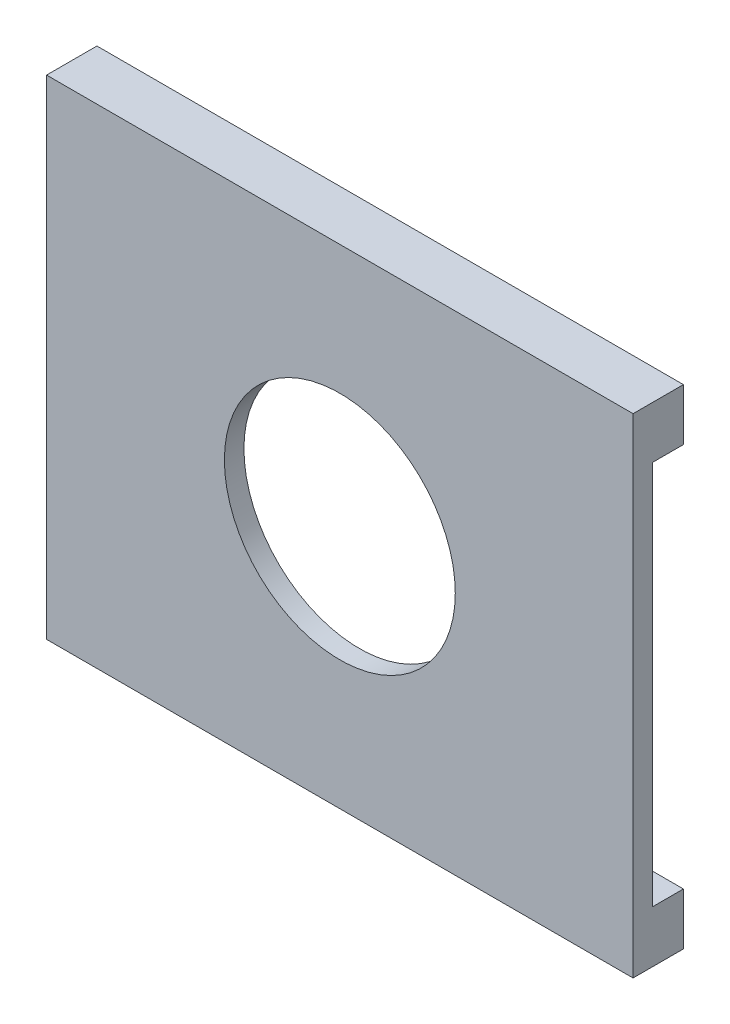
ISO-10303-21;
HEADER;
FILE_DESCRIPTION(('STEP AP214'),'2;1');
FILE_NAME('part.step','',(''),(''),'','','');
FILE_SCHEMA(('AUTOMOTIVE_DESIGN { 1 0 10303 214 1 1 1 1 }'));
ENDSEC;
DATA;
#1=APPLICATION_CONTEXT('core data for automotive mechanical design processes');
#2=APPLICATION_PROTOCOL_DEFINITION('international standard','automotive_design',2000,#1);
#3=PRODUCT_CONTEXT('',#1,'mechanical');
#4=PRODUCT('Part','Part','',(#3));
#5=PRODUCT_RELATED_PRODUCT_CATEGORY('part','',(#4));
#6=PRODUCT_DEFINITION_FORMATION('','',#4);
#7=PRODUCT_DEFINITION_CONTEXT('part definition',#1,'design');
#8=PRODUCT_DEFINITION('design','',#6,#7);
#9=PRODUCT_DEFINITION_SHAPE('','',#8);
#10=(LENGTH_UNIT() NAMED_UNIT(*) SI_UNIT(.MILLI.,.METRE.));
#11=(NAMED_UNIT(*) PLANE_ANGLE_UNIT() SI_UNIT($,.RADIAN.));
#12=(NAMED_UNIT(*) SI_UNIT($,.STERADIAN.) SOLID_ANGLE_UNIT());
#13=UNCERTAINTY_MEASURE_WITH_UNIT(LENGTH_MEASURE(1.E-05),#10,'distance_accuracy_value','');
#14=(GEOMETRIC_REPRESENTATION_CONTEXT(3) GLOBAL_UNCERTAINTY_ASSIGNED_CONTEXT((#13)) GLOBAL_UNIT_ASSIGNED_CONTEXT((#10,
#11,#12)) REPRESENTATION_CONTEXT('',''));
#15=CARTESIAN_POINT('',(0.,0.,0.));
#16=DIRECTION('',(0.,0.,1.));
#17=DIRECTION('',(1.,0.,0.));
#18=AXIS2_PLACEMENT_3D('',#15,#16,#17);
#19=CARTESIAN_POINT('',(0.,0.,0.));
#20=DIRECTION('',(0.,0.,-1.));
#21=DIRECTION('',(-1.,0.,0.));
#22=AXIS2_PLACEMENT_3D('',#19,#20,#21);
#23=PLANE('',#22);
#24=CARTESIAN_POINT('',(38.1,31.75,0.));
#25=DIRECTION('',(0.,0.,-1.));
#26=DIRECTION('',(-1.,0.,0.));
#27=AXIS2_PLACEMENT_3D('',#24,#25,#26);
#28=CIRCLE('',#27,15.);
#29=CARTESIAN_POINT('',(23.1,31.75,0.));
#30=VERTEX_POINT('',#29);
#31=EDGE_CURVE('E221',#30,#30,#28,.T.);
#32=ORIENTED_EDGE('',*,*,#31,.F.);
#33=EDGE_LOOP('',(#32));
#34=FACE_BOUND('',#33,.T.);
#35=DIRECTION('',(-1.,0.,0.));
#36=VECTOR('',#35,1.);
#37=CARTESIAN_POINT('',(0.,56.75,0.));
#38=LINE('',#37,#36);
#39=CARTESIAN_POINT('',(24.13,56.75,0.));
#40=VERTEX_POINT('',#39);
#41=CARTESIAN_POINT('',(0.,56.75,0.));
#42=VERTEX_POINT('',#41);
#43=EDGE_CURVE('E51',#40,#42,#38,.T.);
#44=ORIENTED_EDGE('',*,*,#43,.F.);
#45=DIRECTION('',(0.,1.,0.));
#46=VECTOR('',#45,1.);
#47=CARTESIAN_POINT('',(24.13,46.59,0.));
#48=LINE('',#47,#46);
#49=CARTESIAN_POINT('',(24.13,46.59,0.));
#50=VERTEX_POINT('',#49);
#51=EDGE_CURVE('E164',#50,#40,#48,.T.);
#52=ORIENTED_EDGE('',*,*,#51,.F.);
#53=DIRECTION('',(1.,0.,0.));
#54=VECTOR('',#53,1.);
#55=CARTESIAN_POINT('',(24.13,46.59,0.));
#56=LINE('',#55,#54);
#57=CARTESIAN_POINT('',(27.94,46.59,0.));
#58=VERTEX_POINT('',#57);
#59=EDGE_CURVE('E173',#50,#58,#56,.T.);
#60=ORIENTED_EDGE('',*,*,#59,.T.);
#61=DIRECTION('',(0.,1.,0.));
#62=VECTOR('',#61,1.);
#63=CARTESIAN_POINT('',(27.94,46.59,0.));
#64=LINE('',#63,#62);
#65=CARTESIAN_POINT('',(27.94,56.75,0.));
#66=VERTEX_POINT('',#65);
#67=EDGE_CURVE('E178',#58,#66,#64,.T.);
#68=ORIENTED_EDGE('',*,*,#67,.T.);
#69=CARTESIAN_POINT('',(76.2,56.75,0.));
#70=VERTEX_POINT('',#69);
#71=EDGE_CURVE('E271',#70,#66,#38,.T.);
#72=ORIENTED_EDGE('',*,*,#71,.F.);
#73=DIRECTION('',(0.,1.,0.));
#74=VECTOR('',#73,1.);
#75=CARTESIAN_POINT('',(76.2,0.,0.));
#76=LINE('',#75,#74);
#77=CARTESIAN_POINT('',(76.2,6.75,0.));
#78=VERTEX_POINT('',#77);
#79=EDGE_CURVE('E297',#78,#70,#76,.T.);
#80=ORIENTED_EDGE('',*,*,#79,.F.);
#81=DIRECTION('',(1.,0.,0.));
#82=VECTOR('',#81,1.);
#83=CARTESIAN_POINT('',(0.,6.75,0.));
#84=LINE('',#83,#82);
#85=CARTESIAN_POINT('',(27.94,6.75,0.));
#86=VERTEX_POINT('',#85);
#87=EDGE_CURVE('E246',#86,#78,#84,.T.);
#88=ORIENTED_EDGE('',*,*,#87,.F.);
#89=DIRECTION('',(0.,-1.,0.));
#90=VECTOR('',#89,1.);
#91=CARTESIAN_POINT('',(27.94,16.91,0.));
#92=LINE('',#91,#90);
#93=CARTESIAN_POINT('',(27.94,16.91,0.));
#94=VERTEX_POINT('',#93);
#95=EDGE_CURVE('E185',#94,#86,#92,.T.);
#96=ORIENTED_EDGE('',*,*,#95,.F.);
#97=DIRECTION('',(1.,0.,0.));
#98=VECTOR('',#97,1.);
#99=CARTESIAN_POINT('',(24.13,16.91,0.));
#100=LINE('',#99,#98);
#101=CARTESIAN_POINT('',(24.13,16.91,0.));
#102=VERTEX_POINT('',#101);
#103=EDGE_CURVE('E182',#102,#94,#100,.T.);
#104=ORIENTED_EDGE('',*,*,#103,.F.);
#105=DIRECTION('',(0.,-1.,0.));
#106=VECTOR('',#105,1.);
#107=CARTESIAN_POINT('',(24.13,16.91,0.));
#108=LINE('',#107,#106);
#109=CARTESIAN_POINT('',(24.13,6.75,0.));
#110=VERTEX_POINT('',#109);
#111=EDGE_CURVE('E200',#102,#110,#108,.T.);
#112=ORIENTED_EDGE('',*,*,#111,.T.);
#113=CARTESIAN_POINT('',(0.,6.75,0.));
#114=VERTEX_POINT('',#113);
#115=EDGE_CURVE('E253',#114,#110,#84,.T.);
#116=ORIENTED_EDGE('',*,*,#115,.F.);
#117=DIRECTION('',(0.,-1.,0.));
#118=VECTOR('',#117,1.);
#119=CARTESIAN_POINT('',(0.,0.,0.));
#120=LINE('',#119,#118);
#121=EDGE_CURVE('E287',#42,#114,#120,.T.);
#122=ORIENTED_EDGE('',*,*,#121,.F.);
#123=EDGE_LOOP('',(#44,#52,#60,#68,#72,#80,#88,#96,#104,#112,#116,#122));
#124=FACE_BOUND('',#123,.T.);
#125=ADVANCED_FACE('F47',(#34,#124),#23,.T.);
#126=CARTESIAN_POINT('',(0.,56.75,-4.));
#127=DIRECTION('',(0.,1.,0.));
#128=DIRECTION('',(0.,0.,1.));
#129=AXIS2_PLACEMENT_3D('',#126,#127,#128);
#130=PLANE('',#129);
#131=DIRECTION('',(0.,0.,1.));
#132=VECTOR('',#131,1.);
#133=CARTESIAN_POINT('',(24.13,56.75,-1.27));
#134=LINE('',#133,#132);
#135=CARTESIAN_POINT('',(24.13,56.75,-1.27));
#136=VERTEX_POINT('',#135);
#137=EDGE_CURVE('E65',#136,#40,#134,.T.);
#138=ORIENTED_EDGE('',*,*,#137,.T.);
#139=ORIENTED_EDGE('',*,*,#43,.T.);
#140=DIRECTION('',(0.,0.,1.));
#141=VECTOR('',#140,1.);
#142=CARTESIAN_POINT('',(0.,56.75,-4.));
#143=LINE('',#142,#141);
#144=CARTESIAN_POINT('',(0.,56.75,-4.));
#145=VERTEX_POINT('',#144);
#146=EDGE_CURVE('E277',#145,#42,#143,.T.);
#147=ORIENTED_EDGE('',*,*,#146,.F.);
#148=DIRECTION('',(-1.,0.,0.));
#149=VECTOR('',#148,1.);
#150=CARTESIAN_POINT('',(0.,56.75,-4.));
#151=LINE('',#150,#149);
#152=CARTESIAN_POINT('',(76.2,56.75,-4.));
#153=VERTEX_POINT('',#152);
#154=EDGE_CURVE('E273',#153,#145,#151,.T.);
#155=ORIENTED_EDGE('',*,*,#154,.F.);
#156=DIRECTION('',(0.,0.,1.));
#157=VECTOR('',#156,1.);
#158=CARTESIAN_POINT('',(76.2,56.75,-4.));
#159=LINE('',#158,#157);
#160=EDGE_CURVE('E291',#153,#70,#159,.T.);
#161=ORIENTED_EDGE('',*,*,#160,.T.);
#162=ORIENTED_EDGE('',*,*,#71,.T.);
#163=DIRECTION('',(0.,0.,1.));
#164=VECTOR('',#163,1.);
#165=CARTESIAN_POINT('',(27.94,56.75,-1.27));
#166=LINE('',#165,#164);
#167=CARTESIAN_POINT('',(27.94,56.75,-1.27));
#168=VERTEX_POINT('',#167);
#169=EDGE_CURVE('E540',#168,#66,#166,.T.);
#170=ORIENTED_EDGE('',*,*,#169,.F.);
#171=DIRECTION('',(1.,0.,0.));
#172=VECTOR('',#171,1.);
#173=CARTESIAN_POINT('',(24.13,56.75,-1.27));
#174=LINE('',#173,#172);
#175=EDGE_CURVE('E193',#136,#168,#174,.T.);
#176=ORIENTED_EDGE('',*,*,#175,.F.);
#177=EDGE_LOOP('',(#138,#139,#147,#155,#161,#162,#170,#176));
#178=FACE_BOUND('',#177,.T.);
#179=ADVANCED_FACE('F335',(#178),#130,.F.);
#180=CARTESIAN_POINT('',(0.,6.75,-4.));
#181=DIRECTION('',(0.,-1.,0.));
#182=DIRECTION('',(0.,0.,-1.));
#183=AXIS2_PLACEMENT_3D('',#180,#181,#182);
#184=PLANE('',#183);
#185=DIRECTION('',(0.,0.,1.));
#186=VECTOR('',#185,1.);
#187=CARTESIAN_POINT('',(27.94,6.75,-1.27));
#188=LINE('',#187,#186);
#189=CARTESIAN_POINT('',(27.94,6.75,-1.27));
#190=VERTEX_POINT('',#189);
#191=EDGE_CURVE('E73',#190,#86,#188,.T.);
#192=ORIENTED_EDGE('',*,*,#191,.T.);
#193=ORIENTED_EDGE('',*,*,#87,.T.);
#194=DIRECTION('',(0.,0.,1.));
#195=VECTOR('',#194,1.);
#196=CARTESIAN_POINT('',(76.2,6.75,-4.));
#197=LINE('',#196,#195);
#198=CARTESIAN_POINT('',(76.2,6.75,-4.));
#199=VERTEX_POINT('',#198);
#200=EDGE_CURVE('E260',#199,#78,#197,.T.);
#201=ORIENTED_EDGE('',*,*,#200,.F.);
#202=DIRECTION('',(1.,0.,0.));
#203=VECTOR('',#202,1.);
#204=CARTESIAN_POINT('',(0.,6.75,-4.));
#205=LINE('',#204,#203);
#206=CARTESIAN_POINT('',(0.,6.75,-4.));
#207=VERTEX_POINT('',#206);
#208=EDGE_CURVE('E258',#207,#199,#205,.T.);
#209=ORIENTED_EDGE('',*,*,#208,.F.);
#210=DIRECTION('',(0.,0.,1.));
#211=VECTOR('',#210,1.);
#212=CARTESIAN_POINT('',(0.,6.75,-4.));
#213=LINE('',#212,#211);
#214=EDGE_CURVE('E265',#207,#114,#213,.T.);
#215=ORIENTED_EDGE('',*,*,#214,.T.);
#216=ORIENTED_EDGE('',*,*,#115,.T.);
#217=DIRECTION('',(0.,0.,1.));
#218=VECTOR('',#217,1.);
#219=CARTESIAN_POINT('',(24.13,6.75,-1.27));
#220=LINE('',#219,#218);
#221=CARTESIAN_POINT('',(24.13,6.75,-1.27));
#222=VERTEX_POINT('',#221);
#223=EDGE_CURVE('E213',#222,#110,#220,.T.);
#224=ORIENTED_EDGE('',*,*,#223,.F.);
#225=DIRECTION('',(1.,0.,0.));
#226=VECTOR('',#225,1.);
#227=CARTESIAN_POINT('',(24.13,6.75,-1.27));
#228=LINE('',#227,#226);
#229=EDGE_CURVE('E202',#222,#190,#228,.T.);
#230=ORIENTED_EDGE('',*,*,#229,.T.);
#231=EDGE_LOOP('',(#192,#193,#201,#209,#215,#216,#224,#230));
#232=FACE_BOUND('',#231,.T.);
#233=ADVANCED_FACE('F326',(#232),#184,.F.);
#234=CARTESIAN_POINT('',(0.,0.,2.54));
#235=DIRECTION('',(1.,0.,0.));
#236=DIRECTION('',(0.,0.,-1.));
#237=AXIS2_PLACEMENT_3D('',#234,#235,#236);
#238=PLANE('',#237);
#239=DIRECTION('',(0.,0.,-1.));
#240=VECTOR('',#239,1.);
#241=CARTESIAN_POINT('',(0.,63.5,2.54));
#242=LINE('',#241,#240);
#243=CARTESIAN_POINT('',(0.,63.5,2.54));
#244=VERTEX_POINT('',#243);
#245=CARTESIAN_POINT('',(0.,63.5,-4.));
#246=VERTEX_POINT('',#245);
#247=EDGE_CURVE('E303',#244,#246,#242,.T.);
#248=ORIENTED_EDGE('',*,*,#247,.T.);
#249=DIRECTION('',(0.,1.,0.));
#250=VECTOR('',#249,1.);
#251=CARTESIAN_POINT('',(0.,63.5,-4.));
#252=LINE('',#251,#250);
#253=EDGE_CURVE('E275',#145,#246,#252,.T.);
#254=ORIENTED_EDGE('',*,*,#253,.F.);
#255=ORIENTED_EDGE('',*,*,#146,.T.);
#256=ORIENTED_EDGE('',*,*,#121,.T.);
#257=ORIENTED_EDGE('',*,*,#214,.F.);
#258=DIRECTION('',(0.,1.,0.));
#259=VECTOR('',#258,1.);
#260=CARTESIAN_POINT('',(0.,0.,-4.));
#261=LINE('',#260,#259);
#262=CARTESIAN_POINT('',(0.,0.,-4.));
#263=VERTEX_POINT('',#262);
#264=EDGE_CURVE('E256',#263,#207,#261,.T.);
#265=ORIENTED_EDGE('',*,*,#264,.F.);
#266=DIRECTION('',(0.,0.,-1.));
#267=VECTOR('',#266,1.);
#268=CARTESIAN_POINT('',(0.,0.,2.54));
#269=LINE('',#268,#267);
#270=CARTESIAN_POINT('',(0.,0.,2.54));
#271=VERTEX_POINT('',#270);
#272=EDGE_CURVE('E13',#271,#263,#269,.T.);
#273=ORIENTED_EDGE('',*,*,#272,.F.);
#274=DIRECTION('',(0.,-1.,0.));
#275=VECTOR('',#274,1.);
#276=CARTESIAN_POINT('',(0.,0.,2.54));
#277=LINE('',#276,#275);
#278=EDGE_CURVE('E280',#244,#271,#277,.T.);
#279=ORIENTED_EDGE('',*,*,#278,.F.);
#280=EDGE_LOOP('',(#248,#254,#255,#256,#257,#265,#273,#279));
#281=FACE_BOUND('',#280,.T.);
#282=ADVANCED_FACE('F49',(#281),#238,.F.);
#283=CARTESIAN_POINT('',(0.,0.,2.54));
#284=DIRECTION('',(0.,1.,0.));
#285=DIRECTION('',(0.,0.,1.));
#286=AXIS2_PLACEMENT_3D('',#283,#284,#285);
#287=PLANE('',#286);
#288=ORIENTED_EDGE('',*,*,#272,.T.);
#289=DIRECTION('',(-1.,0.,0.));
#290=VECTOR('',#289,1.);
#291=CARTESIAN_POINT('',(76.2,0.,-4.));
#292=LINE('',#291,#290);
#293=CARTESIAN_POINT('',(76.2,0.,-4.));
#294=VERTEX_POINT('',#293);
#295=EDGE_CURVE('E252',#294,#263,#292,.T.);
#296=ORIENTED_EDGE('',*,*,#295,.F.);
#297=DIRECTION('',(0.,0.,-1.));
#298=VECTOR('',#297,1.);
#299=CARTESIAN_POINT('',(76.2,0.,2.54));
#300=LINE('',#299,#298);
#301=CARTESIAN_POINT('',(76.2,0.,2.54));
#302=VERTEX_POINT('',#301);
#303=EDGE_CURVE('E57',#302,#294,#300,.T.);
#304=ORIENTED_EDGE('',*,*,#303,.F.);
#305=DIRECTION('',(1.,0.,0.));
#306=VECTOR('',#305,1.);
#307=CARTESIAN_POINT('',(0.,0.,2.54));
#308=LINE('',#307,#306);
#309=EDGE_CURVE('E349',#271,#302,#308,.T.);
#310=ORIENTED_EDGE('',*,*,#309,.F.);
#311=EDGE_LOOP('',(#288,#296,#304,#310));
#312=FACE_BOUND('',#311,.T.);
#313=ADVANCED_FACE('F317',(#312),#287,.F.);
#314=CARTESIAN_POINT('',(76.2,0.,2.54));
#315=DIRECTION('',(-1.,0.,0.));
#316=DIRECTION('',(0.,0.,1.));
#317=AXIS2_PLACEMENT_3D('',#314,#315,#316);
#318=PLANE('',#317);
#319=ORIENTED_EDGE('',*,*,#303,.T.);
#320=DIRECTION('',(0.,-1.,0.));
#321=VECTOR('',#320,1.);
#322=CARTESIAN_POINT('',(76.2,6.75,-4.));
#323=LINE('',#322,#321);
#324=EDGE_CURVE('E249',#199,#294,#323,.T.);
#325=ORIENTED_EDGE('',*,*,#324,.F.);
#326=ORIENTED_EDGE('',*,*,#200,.T.);
#327=ORIENTED_EDGE('',*,*,#79,.T.);
#328=ORIENTED_EDGE('',*,*,#160,.F.);
#329=DIRECTION('',(0.,-1.,0.));
#330=VECTOR('',#329,1.);
#331=CARTESIAN_POINT('',(76.2,56.75,-4.));
#332=LINE('',#331,#330);
#333=CARTESIAN_POINT('',(76.2,63.5,-4.));
#334=VERTEX_POINT('',#333);
#335=EDGE_CURVE('E270',#334,#153,#332,.T.);
#336=ORIENTED_EDGE('',*,*,#335,.F.);
#337=DIRECTION('',(0.,0.,-1.));
#338=VECTOR('',#337,1.);
#339=CARTESIAN_POINT('',(76.2,63.5,2.54));
#340=LINE('',#339,#338);
#341=CARTESIAN_POINT('',(76.2,63.5,2.54));
#342=VERTEX_POINT('',#341);
#343=EDGE_CURVE('E305',#342,#334,#340,.T.);
#344=ORIENTED_EDGE('',*,*,#343,.F.);
#345=DIRECTION('',(0.,1.,0.));
#346=VECTOR('',#345,1.);
#347=CARTESIAN_POINT('',(76.2,0.,2.54));
#348=LINE('',#347,#346);
#349=EDGE_CURVE('E315',#302,#342,#348,.T.);
#350=ORIENTED_EDGE('',*,*,#349,.F.);
#351=EDGE_LOOP('',(#319,#325,#326,#327,#328,#336,#344,#350));
#352=FACE_BOUND('',#351,.T.);
#353=ADVANCED_FACE('F313',(#352),#318,.F.);
#354=CARTESIAN_POINT('',(0.,63.5,2.54));
#355=DIRECTION('',(0.,-1.,0.));
#356=DIRECTION('',(0.,0.,-1.));
#357=AXIS2_PLACEMENT_3D('',#354,#355,#356);
#358=PLANE('',#357);
#359=ORIENTED_EDGE('',*,*,#343,.T.);
#360=DIRECTION('',(1.,0.,0.));
#361=VECTOR('',#360,1.);
#362=CARTESIAN_POINT('',(76.2,63.5,-4.));
#363=LINE('',#362,#361);
#364=EDGE_CURVE('E267',#246,#334,#363,.T.);
#365=ORIENTED_EDGE('',*,*,#364,.F.);
#366=ORIENTED_EDGE('',*,*,#247,.F.);
#367=DIRECTION('',(-1.,0.,0.));
#368=VECTOR('',#367,1.);
#369=CARTESIAN_POINT('',(0.,63.5,2.54));
#370=LINE('',#369,#368);
#371=EDGE_CURVE('E306',#342,#244,#370,.T.);
#372=ORIENTED_EDGE('',*,*,#371,.F.);
#373=EDGE_LOOP('',(#359,#365,#366,#372));
#374=FACE_BOUND('',#373,.T.);
#375=ADVANCED_FACE('F345',(#374),#358,.F.);
#376=CARTESIAN_POINT('',(0.,0.,2.54));
#377=DIRECTION('',(0.,0.,-1.));
#378=DIRECTION('',(-1.,0.,0.));
#379=AXIS2_PLACEMENT_3D('',#376,#377,#378);
#380=PLANE('',#379);
#381=CARTESIAN_POINT('',(38.1,31.75,2.54));
#382=DIRECTION('',(0.,0.,1.));
#383=DIRECTION('',(1.,0.,0.));
#384=AXIS2_PLACEMENT_3D('',#381,#382,#383);
#385=CIRCLE('',#384,15.);
#386=CARTESIAN_POINT('',(53.1,31.75,2.54));
#387=VERTEX_POINT('',#386);
#388=EDGE_CURVE('E218',#387,#387,#385,.T.);
#389=ORIENTED_EDGE('',*,*,#388,.F.);
#390=EDGE_LOOP('',(#389));
#391=FACE_BOUND('',#390,.T.);
#392=ORIENTED_EDGE('',*,*,#278,.T.);
#393=ORIENTED_EDGE('',*,*,#309,.T.);
#394=ORIENTED_EDGE('',*,*,#349,.T.);
#395=ORIENTED_EDGE('',*,*,#371,.T.);
#396=EDGE_LOOP('',(#392,#393,#394,#395));
#397=FACE_BOUND('',#396,.T.);
#398=ADVANCED_FACE('F351',(#391,#397),#380,.F.);
#399=CARTESIAN_POINT('',(0.,0.,-4.));
#400=DIRECTION('',(0.,0.,1.));
#401=DIRECTION('',(1.,0.,0.));
#402=AXIS2_PLACEMENT_3D('',#399,#400,#401);
#403=PLANE('',#402);
#404=CARTESIAN_POINT('',(12.7,60.125,-4.));
#405=DIRECTION('',(0.,0.,-1.));
#406=DIRECTION('',(1.,0.,0.));
#407=AXIS2_PLACEMENT_3D('',#404,#405,#406);
#408=CIRCLE('',#407,2.032);
#409=CARTESIAN_POINT('',(14.732,60.125,-4.));
#410=VERTEX_POINT('',#409);
#411=EDGE_CURVE('E224',#410,#410,#408,.T.);
#412=ORIENTED_EDGE('',*,*,#411,.F.);
#413=EDGE_LOOP('',(#412));
#414=FACE_BOUND('',#413,.T.);
#415=CARTESIAN_POINT('',(63.5,60.125,-4.));
#416=DIRECTION('',(0.,0.,-1.));
#417=DIRECTION('',(-1.,0.,0.));
#418=AXIS2_PLACEMENT_3D('',#415,#416,#417);
#419=CIRCLE('',#418,2.032);
#420=CARTESIAN_POINT('',(61.468,60.125,-4.));
#421=VERTEX_POINT('',#420);
#422=EDGE_CURVE('E240',#421,#421,#419,.T.);
#423=ORIENTED_EDGE('',*,*,#422,.F.);
#424=EDGE_LOOP('',(#423));
#425=FACE_BOUND('',#424,.T.);
#426=ORIENTED_EDGE('',*,*,#364,.T.);
#427=ORIENTED_EDGE('',*,*,#335,.T.);
#428=ORIENTED_EDGE('',*,*,#154,.T.);
#429=ORIENTED_EDGE('',*,*,#253,.T.);
#430=EDGE_LOOP('',(#426,#427,#428,#429));
#431=FACE_BOUND('',#430,.T.);
#432=ADVANCED_FACE('F341',(#414,#425,#431),#403,.F.);
#433=CARTESIAN_POINT('',(0.,0.,-4.));
#434=DIRECTION('',(0.,0.,-1.));
#435=DIRECTION('',(-1.,0.,0.));
#436=AXIS2_PLACEMENT_3D('',#433,#434,#435);
#437=PLANE('',#436);
#438=CARTESIAN_POINT('',(12.7,3.375,-4.));
#439=DIRECTION('',(0.,0.,-1.));
#440=DIRECTION('',(-1.,0.,0.));
#441=AXIS2_PLACEMENT_3D('',#438,#439,#440);
#442=CIRCLE('',#441,2.032);
#443=CARTESIAN_POINT('',(10.668,3.375,-4.));
#444=VERTEX_POINT('',#443);
#445=EDGE_CURVE('E228',#444,#444,#442,.T.);
#446=ORIENTED_EDGE('',*,*,#445,.F.);
#447=EDGE_LOOP('',(#446));
#448=FACE_BOUND('',#447,.T.);
#449=CARTESIAN_POINT('',(63.5,3.375,-4.));
#450=DIRECTION('',(0.,0.,-1.));
#451=DIRECTION('',(1.,0.,0.));
#452=AXIS2_PLACEMENT_3D('',#449,#450,#451);
#453=CIRCLE('',#452,2.032);
#454=CARTESIAN_POINT('',(65.5320000000001,3.375,-4.));
#455=VERTEX_POINT('',#454);
#456=EDGE_CURVE('E234',#455,#455,#453,.T.);
#457=ORIENTED_EDGE('',*,*,#456,.F.);
#458=EDGE_LOOP('',(#457));
#459=FACE_BOUND('',#458,.T.);
#460=ORIENTED_EDGE('',*,*,#324,.T.);
#461=ORIENTED_EDGE('',*,*,#295,.T.);
#462=ORIENTED_EDGE('',*,*,#264,.T.);
#463=ORIENTED_EDGE('',*,*,#208,.T.);
#464=EDGE_LOOP('',(#460,#461,#462,#463));
#465=FACE_BOUND('',#464,.T.);
#466=ADVANCED_FACE('F321',(#448,#459,#465),#437,.T.);
#467=CARTESIAN_POINT('',(63.5,60.125,-0.190000000000001));
#468=DIRECTION('',(0.,0.,-1.));
#469=DIRECTION('',(-1.,0.,0.));
#470=AXIS2_PLACEMENT_3D('',#467,#468,#469);
#471=CYLINDRICAL_SURFACE('',#470,2.032);
#472=CARTESIAN_POINT('',(63.5,60.125,-0.190000000000001));
#473=DIRECTION('',(0.,0.,-1.));
#474=DIRECTION('',(-1.,0.,0.));
#475=AXIS2_PLACEMENT_3D('',#472,#473,#474);
#476=CIRCLE('',#475,2.032);
#477=CARTESIAN_POINT('',(61.468,60.125,-0.190000000000001));
#478=VERTEX_POINT('',#477);
#479=EDGE_CURVE('E243',#478,#478,#476,.T.);
#480=ORIENTED_EDGE('',*,*,#479,.F.);
#481=EDGE_LOOP('',(#480));
#482=FACE_BOUND('',#481,.T.);
#483=ORIENTED_EDGE('',*,*,#422,.T.);
#484=EDGE_LOOP('',(#483));
#485=FACE_BOUND('',#484,.T.);
#486=ADVANCED_FACE('F412',(#482,#485),#471,.F.);
#487=CARTESIAN_POINT('',(63.5,60.125,-0.190000000000001));
#488=DIRECTION('',(0.,0.,-1.));
#489=DIRECTION('',(-1.,0.,0.));
#490=AXIS2_PLACEMENT_3D('',#487,#488,#489);
#491=PLANE('',#490);
#492=ORIENTED_EDGE('',*,*,#479,.T.);
#493=EDGE_LOOP('',(#492));
#494=FACE_BOUND('',#493,.T.);
#495=ADVANCED_FACE('F421',(#494),#491,.T.);
#496=CARTESIAN_POINT('',(63.5,3.375,-0.190000000000001));
#497=DIRECTION('',(0.,0.,-1.));
#498=DIRECTION('',(-1.,0.,0.));
#499=AXIS2_PLACEMENT_3D('',#496,#497,#498);
#500=CYLINDRICAL_SURFACE('',#499,2.032);
#501=CARTESIAN_POINT('',(63.5,3.375,-0.190000000000001));
#502=DIRECTION('',(0.,0.,-1.));
#503=DIRECTION('',(1.,0.,0.));
#504=AXIS2_PLACEMENT_3D('',#501,#502,#503);
#505=CIRCLE('',#504,2.032);
#506=CARTESIAN_POINT('',(65.5320000000001,3.375,-0.190000000000001));
#507=VERTEX_POINT('',#506);
#508=EDGE_CURVE('E237',#507,#507,#505,.T.);
#509=ORIENTED_EDGE('',*,*,#508,.F.);
#510=EDGE_LOOP('',(#509));
#511=FACE_BOUND('',#510,.T.);
#512=ORIENTED_EDGE('',*,*,#456,.T.);
#513=EDGE_LOOP('',(#512));
#514=FACE_BOUND('',#513,.T.);
#515=ADVANCED_FACE('F426',(#511,#514),#500,.F.);
#516=CARTESIAN_POINT('',(63.5,3.375,-0.190000000000001));
#517=DIRECTION('',(0.,0.,1.));
#518=DIRECTION('',(1.,0.,0.));
#519=AXIS2_PLACEMENT_3D('',#516,#517,#518);
#520=PLANE('',#519);
#521=ORIENTED_EDGE('',*,*,#508,.T.);
#522=EDGE_LOOP('',(#521));
#523=FACE_BOUND('',#522,.T.);
#524=ADVANCED_FACE('F433',(#523),#520,.F.);
#525=CARTESIAN_POINT('',(12.7,3.375,-0.190000000000001));
#526=DIRECTION('',(0.,0.,-1.));
#527=DIRECTION('',(-1.,0.,0.));
#528=AXIS2_PLACEMENT_3D('',#525,#526,#527);
#529=CYLINDRICAL_SURFACE('',#528,2.032);
#530=CARTESIAN_POINT('',(12.7,3.375,-0.190000000000001));
#531=DIRECTION('',(0.,0.,-1.));
#532=DIRECTION('',(-1.,0.,0.));
#533=AXIS2_PLACEMENT_3D('',#530,#531,#532);
#534=CIRCLE('',#533,2.032);
#535=CARTESIAN_POINT('',(10.668,3.375,-0.190000000000001));
#536=VERTEX_POINT('',#535);
#537=EDGE_CURVE('E231',#536,#536,#534,.T.);
#538=ORIENTED_EDGE('',*,*,#537,.F.);
#539=EDGE_LOOP('',(#538));
#540=FACE_BOUND('',#539,.T.);
#541=ORIENTED_EDGE('',*,*,#445,.T.);
#542=EDGE_LOOP('',(#541));
#543=FACE_BOUND('',#542,.T.);
#544=ADVANCED_FACE('F437',(#540,#543),#529,.F.);
#545=CARTESIAN_POINT('',(12.7,3.375,-0.190000000000001));
#546=DIRECTION('',(0.,0.,-1.));
#547=DIRECTION('',(-1.,0.,0.));
#548=AXIS2_PLACEMENT_3D('',#545,#546,#547);
#549=PLANE('',#548);
#550=ORIENTED_EDGE('',*,*,#537,.T.);
#551=EDGE_LOOP('',(#550));
#552=FACE_BOUND('',#551,.T.);
#553=ADVANCED_FACE('F441',(#552),#549,.T.);
#554=CARTESIAN_POINT('',(12.7,60.125,-0.190000000000001));
#555=DIRECTION('',(0.,0.,-1.));
#556=DIRECTION('',(-1.,0.,0.));
#557=AXIS2_PLACEMENT_3D('',#554,#555,#556);
#558=CYLINDRICAL_SURFACE('',#557,2.032);
#559=CARTESIAN_POINT('',(12.7,60.125,-0.190000000000001));
#560=DIRECTION('',(0.,0.,-1.));
#561=DIRECTION('',(1.,0.,0.));
#562=AXIS2_PLACEMENT_3D('',#559,#560,#561);
#563=CIRCLE('',#562,2.032);
#564=CARTESIAN_POINT('',(14.732,60.125,-0.190000000000001));
#565=VERTEX_POINT('',#564);
#566=EDGE_CURVE('E225',#565,#565,#563,.T.);
#567=ORIENTED_EDGE('',*,*,#566,.F.);
#568=EDGE_LOOP('',(#567));
#569=FACE_BOUND('',#568,.T.);
#570=ORIENTED_EDGE('',*,*,#411,.T.);
#571=EDGE_LOOP('',(#570));
#572=FACE_BOUND('',#571,.T.);
#573=ADVANCED_FACE('F445',(#569,#572),#558,.F.);
#574=CARTESIAN_POINT('',(12.7,60.125,-0.190000000000001));
#575=DIRECTION('',(0.,0.,1.));
#576=DIRECTION('',(1.,0.,0.));
#577=AXIS2_PLACEMENT_3D('',#574,#575,#576);
#578=PLANE('',#577);
#579=ORIENTED_EDGE('',*,*,#566,.T.);
#580=EDGE_LOOP('',(#579));
#581=FACE_BOUND('',#580,.T.);
#582=ADVANCED_FACE('F377',(#581),#578,.F.);
#583=CARTESIAN_POINT('',(38.1,31.75,-7.46));
#584=DIRECTION('',(0.,0.,1.));
#585=DIRECTION('',(1.,0.,0.));
#586=AXIS2_PLACEMENT_3D('',#583,#584,#585);
#587=CYLINDRICAL_SURFACE('',#586,15.);
#588=ORIENTED_EDGE('',*,*,#31,.T.);
#589=EDGE_LOOP('',(#588));
#590=FACE_BOUND('',#589,.T.);
#591=ORIENTED_EDGE('',*,*,#388,.T.);
#592=EDGE_LOOP('',(#591));
#593=FACE_BOUND('',#592,.T.);
#594=ADVANCED_FACE('F369',(#590,#593),#587,.F.);
#595=CARTESIAN_POINT('',(24.13,16.91,-1.27));
#596=DIRECTION('',(0.,-1.,0.));
#597=DIRECTION('',(0.,0.,-1.));
#598=AXIS2_PLACEMENT_3D('',#595,#596,#597);
#599=PLANE('',#598);
#600=ORIENTED_EDGE('',*,*,#103,.T.);
#601=DIRECTION('',(0.,0.,1.));
#602=VECTOR('',#601,1.);
#603=CARTESIAN_POINT('',(27.94,16.91,-1.27));
#604=LINE('',#603,#602);
#605=CARTESIAN_POINT('',(27.94,16.91,-1.27));
#606=VERTEX_POINT('',#605);
#607=EDGE_CURVE('E216',#606,#94,#604,.T.);
#608=ORIENTED_EDGE('',*,*,#607,.F.);
#609=DIRECTION('',(1.,0.,0.));
#610=VECTOR('',#609,1.);
#611=CARTESIAN_POINT('',(24.13,16.91,-1.27));
#612=LINE('',#611,#610);
#613=CARTESIAN_POINT('',(24.13,16.91,-1.27));
#614=VERTEX_POINT('',#613);
#615=EDGE_CURVE('E196',#614,#606,#612,.T.);
#616=ORIENTED_EDGE('',*,*,#615,.F.);
#617=DIRECTION('',(0.,0.,1.));
#618=VECTOR('',#617,1.);
#619=CARTESIAN_POINT('',(24.13,16.91,-1.27));
#620=LINE('',#619,#618);
#621=EDGE_CURVE('E207',#614,#102,#620,.T.);
#622=ORIENTED_EDGE('',*,*,#621,.T.);
#623=EDGE_LOOP('',(#600,#608,#616,#622));
#624=FACE_BOUND('',#623,.T.);
#625=ADVANCED_FACE('F367',(#624),#599,.F.);
#626=CARTESIAN_POINT('',(27.94,16.91,-1.27));
#627=DIRECTION('',(-1.,0.,0.));
#628=DIRECTION('',(0.,0.,1.));
#629=AXIS2_PLACEMENT_3D('',#626,#627,#628);
#630=PLANE('',#629);
#631=ORIENTED_EDGE('',*,*,#95,.T.);
#632=ORIENTED_EDGE('',*,*,#191,.F.);
#633=DIRECTION('',(0.,-1.,0.));
#634=VECTOR('',#633,1.);
#635=CARTESIAN_POINT('',(27.94,16.91,-1.27));
#636=LINE('',#635,#634);
#637=EDGE_CURVE('E199',#606,#190,#636,.T.);
#638=ORIENTED_EDGE('',*,*,#637,.F.);
#639=ORIENTED_EDGE('',*,*,#607,.T.);
#640=EDGE_LOOP('',(#631,#632,#638,#639));
#641=FACE_BOUND('',#640,.T.);
#642=ADVANCED_FACE('F365',(#641),#630,.F.);
#643=CARTESIAN_POINT('',(24.13,16.91,-1.27));
#644=DIRECTION('',(-1.,0.,0.));
#645=DIRECTION('',(0.,0.,1.));
#646=AXIS2_PLACEMENT_3D('',#643,#644,#645);
#647=PLANE('',#646);
#648=ORIENTED_EDGE('',*,*,#111,.F.);
#649=ORIENTED_EDGE('',*,*,#621,.F.);
#650=DIRECTION('',(0.,-1.,0.));
#651=VECTOR('',#650,1.);
#652=CARTESIAN_POINT('',(24.13,16.91,-1.27));
#653=LINE('',#652,#651);
#654=EDGE_CURVE('E205',#614,#222,#653,.T.);
#655=ORIENTED_EDGE('',*,*,#654,.T.);
#656=ORIENTED_EDGE('',*,*,#223,.T.);
#657=EDGE_LOOP('',(#648,#649,#655,#656));
#658=FACE_BOUND('',#657,.T.);
#659=ADVANCED_FACE('F359',(#658),#647,.T.);
#660=CARTESIAN_POINT('',(0.,0.,-1.27));
#661=DIRECTION('',(0.,0.,-1.));
#662=DIRECTION('',(-1.,0.,0.));
#663=AXIS2_PLACEMENT_3D('',#660,#661,#662);
#664=PLANE('',#663);
#665=ORIENTED_EDGE('',*,*,#615,.T.);
#666=ORIENTED_EDGE('',*,*,#637,.T.);
#667=ORIENTED_EDGE('',*,*,#229,.F.);
#668=ORIENTED_EDGE('',*,*,#654,.F.);
#669=EDGE_LOOP('',(#665,#666,#667,#668));
#670=FACE_BOUND('',#669,.T.);
#671=ADVANCED_FACE('F363',(#670),#664,.T.);
#672=CARTESIAN_POINT('',(24.13,46.59,-1.27));
#673=DIRECTION('',(1.,0.,0.));
#674=DIRECTION('',(0.,0.,-1.));
#675=AXIS2_PLACEMENT_3D('',#672,#673,#674);
#676=PLANE('',#675);
#677=ORIENTED_EDGE('',*,*,#51,.T.);
#678=ORIENTED_EDGE('',*,*,#137,.F.);
#679=DIRECTION('',(0.,1.,0.));
#680=VECTOR('',#679,1.);
#681=CARTESIAN_POINT('',(24.13,46.59,-1.27));
#682=LINE('',#681,#680);
#683=CARTESIAN_POINT('',(24.13,46.59,-1.27));
#684=VERTEX_POINT('',#683);
#685=EDGE_CURVE('E165',#684,#136,#682,.T.);
#686=ORIENTED_EDGE('',*,*,#685,.F.);
#687=DIRECTION('',(0.,0.,1.));
#688=VECTOR('',#687,1.);
#689=CARTESIAN_POINT('',(24.13,46.59,-1.27));
#690=LINE('',#689,#688);
#691=EDGE_CURVE('E160',#684,#50,#690,.T.);
#692=ORIENTED_EDGE('',*,*,#691,.T.);
#693=EDGE_LOOP('',(#677,#678,#686,#692));
#694=FACE_BOUND('',#693,.T.);
#695=ADVANCED_FACE('F162',(#694),#676,.F.);
#696=CARTESIAN_POINT('',(27.94,46.59,-1.27));
#697=DIRECTION('',(1.,0.,0.));
#698=DIRECTION('',(0.,0.,-1.));
#699=AXIS2_PLACEMENT_3D('',#696,#697,#698);
#700=PLANE('',#699);
#701=ORIENTED_EDGE('',*,*,#67,.F.);
#702=DIRECTION('',(0.,0.,1.));
#703=VECTOR('',#702,1.);
#704=CARTESIAN_POINT('',(27.94,46.59,-1.27));
#705=LINE('',#704,#703);
#706=CARTESIAN_POINT('',(27.94,46.59,-1.27));
#707=VERTEX_POINT('',#706);
#708=EDGE_CURVE('E170',#707,#58,#705,.T.);
#709=ORIENTED_EDGE('',*,*,#708,.F.);
#710=DIRECTION('',(0.,1.,0.));
#711=VECTOR('',#710,1.);
#712=CARTESIAN_POINT('',(27.94,46.59,-1.27));
#713=LINE('',#712,#711);
#714=EDGE_CURVE('E190',#707,#168,#713,.T.);
#715=ORIENTED_EDGE('',*,*,#714,.T.);
#716=ORIENTED_EDGE('',*,*,#169,.T.);
#717=EDGE_LOOP('',(#701,#709,#715,#716));
#718=FACE_BOUND('',#717,.T.);
#719=ADVANCED_FACE('F505',(#718),#700,.T.);
#720=CARTESIAN_POINT('',(24.13,46.59,-1.27));
#721=DIRECTION('',(0.,-1.,0.));
#722=DIRECTION('',(0.,0.,-1.));
#723=AXIS2_PLACEMENT_3D('',#720,#721,#722);
#724=PLANE('',#723);
#725=ORIENTED_EDGE('',*,*,#59,.F.);
#726=ORIENTED_EDGE('',*,*,#691,.F.);
#727=DIRECTION('',(1.,0.,0.));
#728=VECTOR('',#727,1.);
#729=CARTESIAN_POINT('',(24.13,46.59,-1.27));
#730=LINE('',#729,#728);
#731=EDGE_CURVE('E169',#684,#707,#730,.T.);
#732=ORIENTED_EDGE('',*,*,#731,.T.);
#733=ORIENTED_EDGE('',*,*,#708,.T.);
#734=EDGE_LOOP('',(#725,#726,#732,#733));
#735=FACE_BOUND('',#734,.T.);
#736=ADVANCED_FACE('F174',(#735),#724,.T.);
#737=CARTESIAN_POINT('',(0.,0.,-1.27));
#738=DIRECTION('',(0.,0.,-1.));
#739=DIRECTION('',(-1.,0.,0.));
#740=AXIS2_PLACEMENT_3D('',#737,#738,#739);
#741=PLANE('',#740);
#742=ORIENTED_EDGE('',*,*,#685,.T.);
#743=ORIENTED_EDGE('',*,*,#175,.T.);
#744=ORIENTED_EDGE('',*,*,#714,.F.);
#745=ORIENTED_EDGE('',*,*,#731,.F.);
#746=EDGE_LOOP('',(#742,#743,#744,#745));
#747=FACE_BOUND('',#746,.T.);
#748=ADVANCED_FACE('F521',(#747),#741,.T.);
#749=CLOSED_SHELL('',(#125,#179,#233,#282,#313,#353,#375,#398,#432,#466,#486,#495,#515,#524,
#544,#553,#573,#582,#594,#625,#642,#659,#671,#695,#719,#736,#748));
#750=MANIFOLD_SOLID_BREP('B2',#749);
#751=ADVANCED_BREP_SHAPE_REPRESENTATION('',(#18,#750),#14);
#752=SHAPE_DEFINITION_REPRESENTATION(#9,#751);
ENDSEC;
END-ISO-10303-21;
